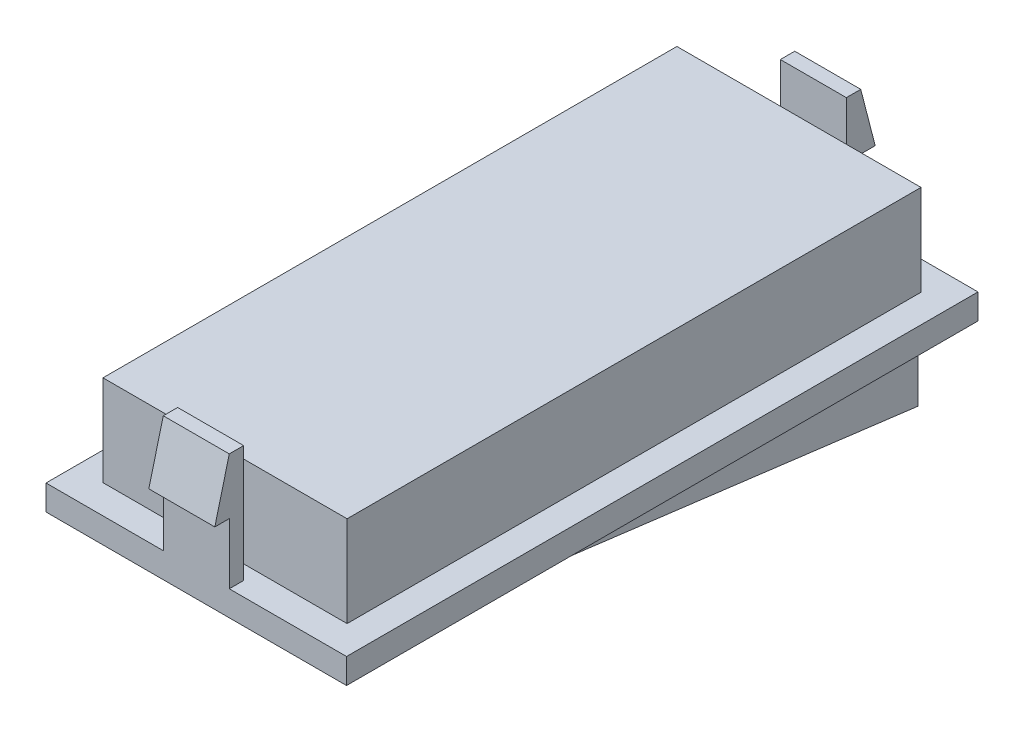
ISO-10303-21;
HEADER;
FILE_DESCRIPTION(('STEP AP214'),'2;1');
FILE_NAME('part.step','',(''),(''),'','','');
FILE_SCHEMA(('AUTOMOTIVE_DESIGN { 1 0 10303 214 1 1 1 1 }'));
ENDSEC;
DATA;
#1=APPLICATION_CONTEXT('core data for automotive mechanical design processes');
#2=APPLICATION_PROTOCOL_DEFINITION('international standard','automotive_design',2000,#1);
#3=PRODUCT_CONTEXT('',#1,'mechanical');
#4=PRODUCT('Part','Part','',(#3));
#5=PRODUCT_RELATED_PRODUCT_CATEGORY('part','',(#4));
#6=PRODUCT_DEFINITION_FORMATION('','',#4);
#7=PRODUCT_DEFINITION_CONTEXT('part definition',#1,'design');
#8=PRODUCT_DEFINITION('design','',#6,#7);
#9=PRODUCT_DEFINITION_SHAPE('','',#8);
#10=(LENGTH_UNIT() NAMED_UNIT(*) SI_UNIT(.MILLI.,.METRE.));
#11=(NAMED_UNIT(*) PLANE_ANGLE_UNIT() SI_UNIT($,.RADIAN.));
#12=(NAMED_UNIT(*) SI_UNIT($,.STERADIAN.) SOLID_ANGLE_UNIT());
#13=UNCERTAINTY_MEASURE_WITH_UNIT(LENGTH_MEASURE(1.E-05),#10,'distance_accuracy_value','');
#14=(GEOMETRIC_REPRESENTATION_CONTEXT(3) GLOBAL_UNCERTAINTY_ASSIGNED_CONTEXT((#13)) GLOBAL_UNIT_ASSIGNED_CONTEXT((#10,
#11,#12)) REPRESENTATION_CONTEXT('',''));
#15=CARTESIAN_POINT('',(0.,0.,0.));
#16=DIRECTION('',(0.,0.,1.));
#17=DIRECTION('',(1.,0.,0.));
#18=AXIS2_PLACEMENT_3D('',#15,#16,#17);
#19=CARTESIAN_POINT('',(-12.065,2.02,25.35));
#20=DIRECTION('',(0.,0.,-1.));
#21=DIRECTION('',(-1.,0.,0.));
#22=AXIS2_PLACEMENT_3D('',#19,#20,#21);
#23=PLANE('',#22);
#24=DIRECTION('',(1.,0.,0.));
#25=VECTOR('',#24,1.);
#26=CARTESIAN_POINT('',(-7.29710662670871,6.9,25.35));
#27=LINE('',#26,#25);
#28=CARTESIAN_POINT('',(-2.65,6.9,25.35));
#29=VERTEX_POINT('',#28);
#30=CARTESIAN_POINT('',(2.65,6.9,25.35));
#31=VERTEX_POINT('',#30);
#32=EDGE_CURVE('E55',#29,#31,#27,.T.);
#33=ORIENTED_EDGE('',*,*,#32,.F.);
#34=DIRECTION('',(0.,1.,0.));
#35=VECTOR('',#34,1.);
#36=CARTESIAN_POINT('',(-2.65,11.4,25.35));
#37=LINE('',#36,#35);
#38=CARTESIAN_POINT('',(-2.65,2.02,25.35));
#39=VERTEX_POINT('',#38);
#40=EDGE_CURVE('E201',#39,#29,#37,.T.);
#41=ORIENTED_EDGE('',*,*,#40,.F.);
#42=DIRECTION('',(1.,0.,0.));
#43=VECTOR('',#42,1.);
#44=CARTESIAN_POINT('',(-12.065,2.02,25.35));
#45=LINE('',#44,#43);
#46=CARTESIAN_POINT('',(-12.065,2.02,25.35));
#47=VERTEX_POINT('',#46);
#48=EDGE_CURVE('E361',#47,#39,#45,.T.);
#49=ORIENTED_EDGE('',*,*,#48,.F.);
#50=DIRECTION('',(0.,-1.,0.));
#51=VECTOR('',#50,1.);
#52=CARTESIAN_POINT('',(-12.065,2.02,25.35));
#53=LINE('',#52,#51);
#54=CARTESIAN_POINT('',(-12.065,0.,25.35));
#55=VERTEX_POINT('',#54);
#56=EDGE_CURVE('E11',#47,#55,#53,.T.);
#57=ORIENTED_EDGE('',*,*,#56,.T.);
#58=DIRECTION('',(1.,0.,0.));
#59=VECTOR('',#58,1.);
#60=CARTESIAN_POINT('',(-12.065,0.,25.35));
#61=LINE('',#60,#59);
#62=CARTESIAN_POINT('',(12.065,0.,25.35));
#63=VERTEX_POINT('',#62);
#64=EDGE_CURVE('E354',#55,#63,#61,.T.);
#65=ORIENTED_EDGE('',*,*,#64,.T.);
#66=DIRECTION('',(0.,-1.,0.));
#67=VECTOR('',#66,1.);
#68=CARTESIAN_POINT('',(12.065,2.02,25.35));
#69=LINE('',#68,#67);
#70=CARTESIAN_POINT('',(12.065,2.02,25.35));
#71=VERTEX_POINT('',#70);
#72=EDGE_CURVE('E47',#71,#63,#69,.T.);
#73=ORIENTED_EDGE('',*,*,#72,.F.);
#74=CARTESIAN_POINT('',(2.65,2.02,25.35));
#75=VERTEX_POINT('',#74);
#76=EDGE_CURVE('E195',#75,#71,#45,.T.);
#77=ORIENTED_EDGE('',*,*,#76,.F.);
#78=DIRECTION('',(0.,-1.,0.));
#79=VECTOR('',#78,1.);
#80=CARTESIAN_POINT('',(2.65,11.4,25.35));
#81=LINE('',#80,#79);
#82=EDGE_CURVE('E193',#31,#75,#81,.T.);
#83=ORIENTED_EDGE('',*,*,#82,.F.);
#84=EDGE_LOOP('',(#33,#41,#49,#57,#65,#73,#77,#83));
#85=FACE_BOUND('',#84,.T.);
#86=ADVANCED_FACE('F38',(#85),#23,.F.);
#87=CARTESIAN_POINT('',(0.,2.02,0.));
#88=DIRECTION('',(0.,-1.,0.));
#89=DIRECTION('',(0.,0.,-1.));
#90=AXIS2_PLACEMENT_3D('',#87,#88,#89);
#91=PLANE('',#90);
#92=DIRECTION('',(0.,0.,-1.));
#93=VECTOR('',#92,1.);
#94=CARTESIAN_POINT('',(9.8,2.02,23.04));
#95=LINE('',#94,#93);
#96=CARTESIAN_POINT('',(9.8,2.02,23.04));
#97=VERTEX_POINT('',#96);
#98=CARTESIAN_POINT('',(9.8,2.02,-23.04));
#99=VERTEX_POINT('',#98);
#100=EDGE_CURVE('E298',#97,#99,#95,.T.);
#101=ORIENTED_EDGE('',*,*,#100,.F.);
#102=DIRECTION('',(1.,0.,0.));
#103=VECTOR('',#102,1.);
#104=CARTESIAN_POINT('',(-9.8,2.02,23.04));
#105=LINE('',#104,#103);
#106=CARTESIAN_POINT('',(-9.8,2.02,23.04));
#107=VERTEX_POINT('',#106);
#108=EDGE_CURVE('E321',#107,#97,#105,.T.);
#109=ORIENTED_EDGE('',*,*,#108,.F.);
#110=DIRECTION('',(0.,0.,1.));
#111=VECTOR('',#110,1.);
#112=CARTESIAN_POINT('',(-9.8,2.02,23.04));
#113=LINE('',#112,#111);
#114=CARTESIAN_POINT('',(-9.8,2.02,-23.04));
#115=VERTEX_POINT('',#114);
#116=EDGE_CURVE('E333',#115,#107,#113,.T.);
#117=ORIENTED_EDGE('',*,*,#116,.F.);
#118=DIRECTION('',(-1.,0.,0.));
#119=VECTOR('',#118,1.);
#120=CARTESIAN_POINT('',(-9.8,2.02,-23.04));
#121=LINE('',#120,#119);
#122=EDGE_CURVE('E330',#99,#115,#121,.T.);
#123=ORIENTED_EDGE('',*,*,#122,.F.);
#124=EDGE_LOOP('',(#101,#109,#117,#123));
#125=FACE_BOUND('',#124,.T.);
#126=DIRECTION('',(0.,0.,1.));
#127=VECTOR('',#126,1.);
#128=CARTESIAN_POINT('',(-2.65,2.02,24.195));
#129=LINE('',#128,#127);
#130=CARTESIAN_POINT('',(-2.65,2.02,24.195));
#131=VERTEX_POINT('',#130);
#132=EDGE_CURVE('E63',#131,#39,#129,.T.);
#133=ORIENTED_EDGE('',*,*,#132,.F.);
#134=DIRECTION('',(-1.,0.,0.));
#135=VECTOR('',#134,1.);
#136=CARTESIAN_POINT('',(2.65,2.02,24.195));
#137=LINE('',#136,#135);
#138=CARTESIAN_POINT('',(2.65,2.02,24.195));
#139=VERTEX_POINT('',#138);
#140=EDGE_CURVE('E228',#139,#131,#137,.T.);
#141=ORIENTED_EDGE('',*,*,#140,.F.);
#142=DIRECTION('',(0.,0.,1.));
#143=VECTOR('',#142,1.);
#144=CARTESIAN_POINT('',(2.65,2.02,24.195));
#145=LINE('',#144,#143);
#146=EDGE_CURVE('E242',#139,#75,#145,.T.);
#147=ORIENTED_EDGE('',*,*,#146,.T.);
#148=ORIENTED_EDGE('',*,*,#76,.T.);
#149=DIRECTION('',(0.,0.,-1.));
#150=VECTOR('',#149,1.);
#151=CARTESIAN_POINT('',(12.065,2.02,25.35));
#152=LINE('',#151,#150);
#153=CARTESIAN_POINT('',(12.065,2.02,-25.35));
#154=VERTEX_POINT('',#153);
#155=EDGE_CURVE('E358',#71,#154,#152,.T.);
#156=ORIENTED_EDGE('',*,*,#155,.T.);
#157=DIRECTION('',(1.,0.,0.));
#158=VECTOR('',#157,1.);
#159=CARTESIAN_POINT('',(-12.065,2.02,-25.35));
#160=LINE('',#159,#158);
#161=CARTESIAN_POINT('',(2.64999999999999,2.02,-25.35));
#162=VERTEX_POINT('',#161);
#163=EDGE_CURVE('E353',#162,#154,#160,.T.);
#164=ORIENTED_EDGE('',*,*,#163,.F.);
#165=DIRECTION('',(0.,0.,-1.));
#166=VECTOR('',#165,1.);
#167=CARTESIAN_POINT('',(2.65,2.02,-24.195));
#168=LINE('',#167,#166);
#169=CARTESIAN_POINT('',(2.65,2.02,-24.195));
#170=VERTEX_POINT('',#169);
#171=EDGE_CURVE('E283',#170,#162,#168,.T.);
#172=ORIENTED_EDGE('',*,*,#171,.F.);
#173=DIRECTION('',(-1.,0.,0.));
#174=VECTOR('',#173,1.);
#175=CARTESIAN_POINT('',(2.65,2.02,-24.195));
#176=LINE('',#175,#174);
#177=CARTESIAN_POINT('',(-2.65,2.02,-24.195));
#178=VERTEX_POINT('',#177);
#179=EDGE_CURVE('E270',#170,#178,#176,.T.);
#180=ORIENTED_EDGE('',*,*,#179,.T.);
#181=DIRECTION('',(0.,0.,-1.));
#182=VECTOR('',#181,1.);
#183=CARTESIAN_POINT('',(-2.65,2.02,-24.195));
#184=LINE('',#183,#182);
#185=CARTESIAN_POINT('',(-2.65,2.02,-25.35));
#186=VERTEX_POINT('',#185);
#187=EDGE_CURVE('E279',#178,#186,#184,.T.);
#188=ORIENTED_EDGE('',*,*,#187,.T.);
#189=CARTESIAN_POINT('',(-12.065,2.02,-25.35));
#190=VERTEX_POINT('',#189);
#191=EDGE_CURVE('E355',#190,#186,#160,.T.);
#192=ORIENTED_EDGE('',*,*,#191,.F.);
#193=DIRECTION('',(0.,0.,-1.));
#194=VECTOR('',#193,1.);
#195=CARTESIAN_POINT('',(-12.065,2.02,25.35));
#196=LINE('',#195,#194);
#197=EDGE_CURVE('E350',#47,#190,#196,.T.);
#198=ORIENTED_EDGE('',*,*,#197,.F.);
#199=ORIENTED_EDGE('',*,*,#48,.T.);
#200=EDGE_LOOP('',(#133,#141,#147,#148,#156,#164,#172,#180,#188,#192,#198,#199));
#201=FACE_BOUND('',#200,.T.);
#202=ADVANCED_FACE('F391',(#125,#201),#91,.F.);
#203=CARTESIAN_POINT('',(-12.065,2.02,-25.35));
#204=DIRECTION('',(0.,0.,-1.));
#205=DIRECTION('',(-1.,0.,0.));
#206=AXIS2_PLACEMENT_3D('',#203,#204,#205);
#207=PLANE('',#206);
#208=DIRECTION('',(0.,1.,0.));
#209=VECTOR('',#208,1.);
#210=CARTESIAN_POINT('',(-2.65,11.4,-25.35));
#211=LINE('',#210,#209);
#212=CARTESIAN_POINT('',(-2.65,6.9,-25.35));
#213=VERTEX_POINT('',#212);
#214=EDGE_CURVE('E253',#186,#213,#211,.T.);
#215=ORIENTED_EDGE('',*,*,#214,.T.);
#216=DIRECTION('',(1.,0.,0.));
#217=VECTOR('',#216,1.);
#218=CARTESIAN_POINT('',(-7.29710662670871,6.9,-25.35));
#219=LINE('',#218,#217);
#220=CARTESIAN_POINT('',(2.65,6.9,-25.35));
#221=VERTEX_POINT('',#220);
#222=EDGE_CURVE('E248',#213,#221,#219,.T.);
#223=ORIENTED_EDGE('',*,*,#222,.T.);
#224=DIRECTION('',(0.,-1.,0.));
#225=VECTOR('',#224,1.);
#226=CARTESIAN_POINT('',(2.65,11.4,-25.35));
#227=LINE('',#226,#225);
#228=EDGE_CURVE('E265',#221,#162,#227,.T.);
#229=ORIENTED_EDGE('',*,*,#228,.T.);
#230=ORIENTED_EDGE('',*,*,#163,.T.);
#231=DIRECTION('',(0.,-1.,0.));
#232=VECTOR('',#231,1.);
#233=CARTESIAN_POINT('',(12.065,2.02,-25.35));
#234=LINE('',#233,#232);
#235=CARTESIAN_POINT('',(12.065,0.,-25.35));
#236=VERTEX_POINT('',#235);
#237=EDGE_CURVE('E373',#154,#236,#234,.T.);
#238=ORIENTED_EDGE('',*,*,#237,.T.);
#239=DIRECTION('',(1.,0.,0.));
#240=VECTOR('',#239,1.);
#241=CARTESIAN_POINT('',(-12.065,0.,-25.35));
#242=LINE('',#241,#240);
#243=CARTESIAN_POINT('',(-12.065,0.,-25.35));
#244=VERTEX_POINT('',#243);
#245=EDGE_CURVE('E365',#244,#236,#242,.T.);
#246=ORIENTED_EDGE('',*,*,#245,.F.);
#247=DIRECTION('',(0.,-1.,0.));
#248=VECTOR('',#247,1.);
#249=CARTESIAN_POINT('',(-12.065,2.02,-25.35));
#250=LINE('',#249,#248);
#251=EDGE_CURVE('E42',#190,#244,#250,.T.);
#252=ORIENTED_EDGE('',*,*,#251,.F.);
#253=ORIENTED_EDGE('',*,*,#191,.T.);
#254=EDGE_LOOP('',(#215,#223,#229,#230,#238,#246,#252,#253));
#255=FACE_BOUND('',#254,.T.);
#256=ADVANCED_FACE('F381',(#255),#207,.T.);
#257=CARTESIAN_POINT('',(-12.065,2.02,25.35));
#258=DIRECTION('',(-1.,0.,0.));
#259=DIRECTION('',(0.,0.,1.));
#260=AXIS2_PLACEMENT_3D('',#257,#258,#259);
#261=PLANE('',#260);
#262=DIRECTION('',(0.,0.,-1.));
#263=VECTOR('',#262,1.);
#264=CARTESIAN_POINT('',(-12.065,0.,25.35));
#265=LINE('',#264,#263);
#266=EDGE_CURVE('E349',#55,#244,#265,.T.);
#267=ORIENTED_EDGE('',*,*,#266,.F.);
#268=ORIENTED_EDGE('',*,*,#56,.F.);
#269=ORIENTED_EDGE('',*,*,#197,.T.);
#270=ORIENTED_EDGE('',*,*,#251,.T.);
#271=EDGE_LOOP('',(#267,#268,#269,#270));
#272=FACE_BOUND('',#271,.T.);
#273=ADVANCED_FACE('F40',(#272),#261,.T.);
#274=CARTESIAN_POINT('',(12.065,2.02,25.35));
#275=DIRECTION('',(-1.,0.,0.));
#276=DIRECTION('',(0.,0.,1.));
#277=AXIS2_PLACEMENT_3D('',#274,#275,#276);
#278=PLANE('',#277);
#279=DIRECTION('',(0.,0.,-1.));
#280=VECTOR('',#279,1.);
#281=CARTESIAN_POINT('',(12.065,0.,25.35));
#282=LINE('',#281,#280);
#283=EDGE_CURVE('E368',#63,#236,#282,.T.);
#284=ORIENTED_EDGE('',*,*,#283,.T.);
#285=ORIENTED_EDGE('',*,*,#237,.F.);
#286=ORIENTED_EDGE('',*,*,#155,.F.);
#287=ORIENTED_EDGE('',*,*,#72,.T.);
#288=EDGE_LOOP('',(#284,#285,#286,#287));
#289=FACE_BOUND('',#288,.T.);
#290=ADVANCED_FACE('F389',(#289),#278,.F.);
#291=CARTESIAN_POINT('',(0.,0.,0.));
#292=DIRECTION('',(0.,-1.,0.));
#293=DIRECTION('',(0.,0.,-1.));
#294=AXIS2_PLACEMENT_3D('',#291,#292,#293);
#295=PLANE('',#294);
#296=DIRECTION('',(1.,0.,0.));
#297=VECTOR('',#296,1.);
#298=CARTESIAN_POINT('',(-55.8306603191244,0.,-22.7812510723654));
#299=LINE('',#298,#297);
#300=CARTESIAN_POINT('',(-9.8,0.,-22.7812510723654));
#301=VERTEX_POINT('',#300);
#302=CARTESIAN_POINT('',(9.8,0.,-22.7812510723654));
#303=VERTEX_POINT('',#302);
#304=EDGE_CURVE('E309',#301,#303,#299,.T.);
#305=ORIENTED_EDGE('',*,*,#304,.F.);
#306=DIRECTION('',(0.,0.,1.));
#307=VECTOR('',#306,1.);
#308=CARTESIAN_POINT('',(-9.8,0.,23.04));
#309=LINE('',#308,#307);
#310=CARTESIAN_POINT('',(-9.8,0.,22.8849433915694));
#311=VERTEX_POINT('',#310);
#312=EDGE_CURVE('E291',#301,#311,#309,.T.);
#313=ORIENTED_EDGE('',*,*,#312,.T.);
#314=DIRECTION('',(1.,0.,0.));
#315=VECTOR('',#314,1.);
#316=CARTESIAN_POINT('',(-55.8306603191244,0.,22.8849433915694));
#317=LINE('',#316,#315);
#318=CARTESIAN_POINT('',(9.8,0.,22.8849433915694));
#319=VERTEX_POINT('',#318);
#320=EDGE_CURVE('E312',#311,#319,#317,.T.);
#321=ORIENTED_EDGE('',*,*,#320,.T.);
#322=DIRECTION('',(0.,0.,-1.));
#323=VECTOR('',#322,1.);
#324=CARTESIAN_POINT('',(9.8,0.,23.04));
#325=LINE('',#324,#323);
#326=EDGE_CURVE('E301',#319,#303,#325,.T.);
#327=ORIENTED_EDGE('',*,*,#326,.T.);
#328=EDGE_LOOP('',(#305,#313,#321,#327));
#329=FACE_BOUND('',#328,.T.);
#330=ORIENTED_EDGE('',*,*,#266,.T.);
#331=ORIENTED_EDGE('',*,*,#245,.T.);
#332=ORIENTED_EDGE('',*,*,#283,.F.);
#333=ORIENTED_EDGE('',*,*,#64,.F.);
#334=EDGE_LOOP('',(#330,#331,#332,#333));
#335=FACE_BOUND('',#334,.T.);
#336=ADVANCED_FACE('F385',(#329,#335),#295,.T.);
#337=CARTESIAN_POINT('',(9.8,9.31,23.04));
#338=DIRECTION('',(-1.,0.,0.));
#339=DIRECTION('',(0.,0.,1.));
#340=AXIS2_PLACEMENT_3D('',#337,#338,#339);
#341=PLANE('',#340);
#342=ORIENTED_EDGE('',*,*,#100,.T.);
#343=DIRECTION('',(0.,-1.,0.));
#344=VECTOR('',#343,1.);
#345=CARTESIAN_POINT('',(9.8,9.31,-23.04));
#346=LINE('',#345,#344);
#347=CARTESIAN_POINT('',(9.8,9.31,-23.04));
#348=VERTEX_POINT('',#347);
#349=EDGE_CURVE('E346',#348,#99,#346,.T.);
#350=ORIENTED_EDGE('',*,*,#349,.F.);
#351=DIRECTION('',(0.,0.,-1.));
#352=VECTOR('',#351,1.);
#353=CARTESIAN_POINT('',(9.8,9.31,23.04));
#354=LINE('',#353,#352);
#355=CARTESIAN_POINT('',(9.8,9.31,23.04));
#356=VERTEX_POINT('',#355);
#357=EDGE_CURVE('E317',#356,#348,#354,.T.);
#358=ORIENTED_EDGE('',*,*,#357,.F.);
#359=DIRECTION('',(0.,-1.,0.));
#360=VECTOR('',#359,1.);
#361=CARTESIAN_POINT('',(9.8,9.31,23.04));
#362=LINE('',#361,#360);
#363=EDGE_CURVE('E327',#356,#97,#362,.T.);
#364=ORIENTED_EDGE('',*,*,#363,.T.);
#365=EDGE_LOOP('',(#342,#350,#358,#364));
#366=FACE_BOUND('',#365,.T.);
#367=ADVANCED_FACE('F467',(#366),#341,.F.);
#368=CARTESIAN_POINT('',(-9.8,9.31,-23.04));
#369=DIRECTION('',(0.,0.,1.));
#370=DIRECTION('',(1.,0.,0.));
#371=AXIS2_PLACEMENT_3D('',#368,#369,#370);
#372=PLANE('',#371);
#373=ORIENTED_EDGE('',*,*,#122,.T.);
#374=DIRECTION('',(0.,-1.,0.));
#375=VECTOR('',#374,1.);
#376=CARTESIAN_POINT('',(-9.8,9.31,-23.04));
#377=LINE('',#376,#375);
#378=CARTESIAN_POINT('',(-9.8,9.31,-23.04));
#379=VERTEX_POINT('',#378);
#380=EDGE_CURVE('E343',#379,#115,#377,.T.);
#381=ORIENTED_EDGE('',*,*,#380,.F.);
#382=DIRECTION('',(-1.,0.,0.));
#383=VECTOR('',#382,1.);
#384=CARTESIAN_POINT('',(-9.8,9.31,-23.04));
#385=LINE('',#384,#383);
#386=EDGE_CURVE('E320',#348,#379,#385,.T.);
#387=ORIENTED_EDGE('',*,*,#386,.F.);
#388=ORIENTED_EDGE('',*,*,#349,.T.);
#389=EDGE_LOOP('',(#373,#381,#387,#388));
#390=FACE_BOUND('',#389,.T.);
#391=ADVANCED_FACE('F477',(#390),#372,.F.);
#392=CARTESIAN_POINT('',(-9.8,9.31,23.04));
#393=DIRECTION('',(1.,0.,0.));
#394=DIRECTION('',(0.,0.,-1.));
#395=AXIS2_PLACEMENT_3D('',#392,#393,#394);
#396=PLANE('',#395);
#397=ORIENTED_EDGE('',*,*,#116,.T.);
#398=DIRECTION('',(0.,-1.,0.));
#399=VECTOR('',#398,1.);
#400=CARTESIAN_POINT('',(-9.8,9.31,23.04));
#401=LINE('',#400,#399);
#402=CARTESIAN_POINT('',(-9.8,9.31,23.04));
#403=VERTEX_POINT('',#402);
#404=EDGE_CURVE('E340',#403,#107,#401,.T.);
#405=ORIENTED_EDGE('',*,*,#404,.F.);
#406=DIRECTION('',(0.,0.,1.));
#407=VECTOR('',#406,1.);
#408=CARTESIAN_POINT('',(-9.8,9.31,23.04));
#409=LINE('',#408,#407);
#410=EDGE_CURVE('E323',#379,#403,#409,.T.);
#411=ORIENTED_EDGE('',*,*,#410,.F.);
#412=ORIENTED_EDGE('',*,*,#380,.T.);
#413=EDGE_LOOP('',(#397,#405,#411,#412));
#414=FACE_BOUND('',#413,.T.);
#415=ADVANCED_FACE('F484',(#414),#396,.F.);
#416=CARTESIAN_POINT('',(-9.8,9.31,23.04));
#417=DIRECTION('',(0.,0.,-1.));
#418=DIRECTION('',(-1.,0.,0.));
#419=AXIS2_PLACEMENT_3D('',#416,#417,#418);
#420=PLANE('',#419);
#421=ORIENTED_EDGE('',*,*,#108,.T.);
#422=ORIENTED_EDGE('',*,*,#363,.F.);
#423=DIRECTION('',(1.,0.,0.));
#424=VECTOR('',#423,1.);
#425=CARTESIAN_POINT('',(-9.8,9.31,23.04));
#426=LINE('',#425,#424);
#427=EDGE_CURVE('E325',#403,#356,#426,.T.);
#428=ORIENTED_EDGE('',*,*,#427,.F.);
#429=ORIENTED_EDGE('',*,*,#404,.T.);
#430=EDGE_LOOP('',(#421,#422,#428,#429));
#431=FACE_BOUND('',#430,.T.);
#432=ADVANCED_FACE('F492',(#431),#420,.F.);
#433=CARTESIAN_POINT('',(0.,9.31,0.));
#434=DIRECTION('',(0.,-1.,0.));
#435=DIRECTION('',(0.,0.,-1.));
#436=AXIS2_PLACEMENT_3D('',#433,#434,#435);
#437=PLANE('',#436);
#438=ORIENTED_EDGE('',*,*,#357,.T.);
#439=ORIENTED_EDGE('',*,*,#386,.T.);
#440=ORIENTED_EDGE('',*,*,#410,.T.);
#441=ORIENTED_EDGE('',*,*,#427,.T.);
#442=EDGE_LOOP('',(#438,#439,#440,#441));
#443=FACE_BOUND('',#442,.T.);
#444=ADVANCED_FACE('F500',(#443),#437,.F.);
#445=CARTESIAN_POINT('',(9.8,0.,0.));
#446=DIRECTION('',(1.,0.,0.));
#447=DIRECTION('',(0.,0.,-1.));
#448=AXIS2_PLACEMENT_3D('',#445,#446,#447);
#449=PLANE('',#448);
#450=DIRECTION('',(0.,0.125590976946734,0.992082106737928));
#451=VECTOR('',#450,1.);
#452=CARTESIAN_POINT('',(9.8,0.166167020566189,24.1975482604972));
#453=LINE('',#452,#451);
#454=CARTESIAN_POINT('',(9.8,-5.78103559898209,-22.7812510723654));
#455=VERTEX_POINT('',#454);
#456=EDGE_CURVE('E282',#455,#319,#453,.T.);
#457=ORIENTED_EDGE('',*,*,#456,.F.);
#458=DIRECTION('',(0.,-1.,0.));
#459=VECTOR('',#458,1.);
#460=CARTESIAN_POINT('',(9.8,9.31000000000006,-22.7812510723654));
#461=LINE('',#460,#459);
#462=EDGE_CURVE('E304',#303,#455,#461,.T.);
#463=ORIENTED_EDGE('',*,*,#462,.F.);
#464=ORIENTED_EDGE('',*,*,#326,.F.);
#465=EDGE_LOOP('',(#457,#463,#464));
#466=FACE_BOUND('',#465,.T.);
#467=ADVANCED_FACE('F507',(#466),#449,.T.);
#468=CARTESIAN_POINT('',(-55.8306603191244,9.31000000000006,-22.7812510723654));
#469=DIRECTION('',(0.,0.,1.));
#470=DIRECTION('',(0.,-1.,0.));
#471=AXIS2_PLACEMENT_3D('',#468,#469,#470);
#472=PLANE('',#471);
#473=DIRECTION('',(1.,0.,0.));
#474=VECTOR('',#473,1.);
#475=CARTESIAN_POINT('',(-55.8306603191244,-5.78103559898209,-22.7812510723654));
#476=LINE('',#475,#474);
#477=CARTESIAN_POINT('',(-9.8,-5.78103559898209,-22.7812510723654));
#478=VERTEX_POINT('',#477);
#479=EDGE_CURVE('E307',#478,#455,#476,.T.);
#480=ORIENTED_EDGE('',*,*,#479,.F.);
#481=DIRECTION('',(0.,1.,0.));
#482=VECTOR('',#481,1.);
#483=CARTESIAN_POINT('',(-9.8,9.31000000000006,-22.7812510723654));
#484=LINE('',#483,#482);
#485=EDGE_CURVE('E295',#478,#301,#484,.T.);
#486=ORIENTED_EDGE('',*,*,#485,.T.);
#487=ORIENTED_EDGE('',*,*,#304,.T.);
#488=ORIENTED_EDGE('',*,*,#462,.T.);
#489=EDGE_LOOP('',(#480,#486,#487,#488));
#490=FACE_BOUND('',#489,.T.);
#491=ADVANCED_FACE('F514',(#490),#472,.F.);
#492=CARTESIAN_POINT('',(-55.8306603191244,0.166167020566189,24.1975482604972));
#493=DIRECTION('',(0.,0.992082106737928,-0.125590976946734));
#494=DIRECTION('',(0.,0.125590976946734,0.992082106737928));
#495=AXIS2_PLACEMENT_3D('',#492,#493,#494);
#496=PLANE('',#495);
#497=ORIENTED_EDGE('',*,*,#320,.F.);
#498=DIRECTION('',(0.,-0.125590976946734,-0.992082106737928));
#499=VECTOR('',#498,1.);
#500=CARTESIAN_POINT('',(-9.8,0.166167020566189,24.1975482604972));
#501=LINE('',#500,#499);
#502=EDGE_CURVE('E294',#311,#478,#501,.T.);
#503=ORIENTED_EDGE('',*,*,#502,.T.);
#504=ORIENTED_EDGE('',*,*,#479,.T.);
#505=ORIENTED_EDGE('',*,*,#456,.T.);
#506=EDGE_LOOP('',(#497,#503,#504,#505));
#507=FACE_BOUND('',#506,.T.);
#508=ADVANCED_FACE('F522',(#507),#496,.F.);
#509=CARTESIAN_POINT('',(-9.8,9.31,23.04));
#510=DIRECTION('',(1.,0.,0.));
#511=DIRECTION('',(0.,0.,-1.));
#512=AXIS2_PLACEMENT_3D('',#509,#510,#511);
#513=PLANE('',#512);
#514=ORIENTED_EDGE('',*,*,#312,.F.);
#515=ORIENTED_EDGE('',*,*,#485,.F.);
#516=ORIENTED_EDGE('',*,*,#502,.F.);
#517=EDGE_LOOP('',(#514,#515,#516));
#518=FACE_BOUND('',#517,.T.);
#519=ADVANCED_FACE('F529',(#518),#513,.F.);
#520=CARTESIAN_POINT('',(-2.65,11.4,-24.195));
#521=DIRECTION('',(-1.,0.,0.));
#522=DIRECTION('',(0.,-1.,0.));
#523=AXIS2_PLACEMENT_3D('',#520,#521,#522);
#524=PLANE('',#523);
#525=ORIENTED_EDGE('',*,*,#214,.F.);
#526=ORIENTED_EDGE('',*,*,#187,.F.);
#527=DIRECTION('',(0.,1.,0.));
#528=VECTOR('',#527,1.);
#529=CARTESIAN_POINT('',(-2.65,11.4,-24.195));
#530=LINE('',#529,#528);
#531=CARTESIAN_POINT('',(-2.65,11.4,-24.195));
#532=VERTEX_POINT('',#531);
#533=EDGE_CURVE('E261',#178,#532,#530,.T.);
#534=ORIENTED_EDGE('',*,*,#533,.T.);
#535=DIRECTION('',(0.,0.,-1.));
#536=VECTOR('',#535,1.);
#537=CARTESIAN_POINT('',(-2.65,11.4,-24.195));
#538=LINE('',#537,#536);
#539=CARTESIAN_POINT('',(-2.65,11.4,-25.35));
#540=VERTEX_POINT('',#539);
#541=EDGE_CURVE('E273',#532,#540,#538,.T.);
#542=ORIENTED_EDGE('',*,*,#541,.T.);
#543=DIRECTION('',(0.,0.968344469252496,0.24961768540731));
#544=VECTOR('',#543,1.);
#545=CARTESIAN_POINT('',(-2.65,6.9,-26.51));
#546=LINE('',#545,#544);
#547=CARTESIAN_POINT('',(-2.65,6.9,-26.51));
#548=VERTEX_POINT('',#547);
#549=EDGE_CURVE('E251',#548,#540,#546,.T.);
#550=ORIENTED_EDGE('',*,*,#549,.F.);
#551=DIRECTION('',(0.,0.,-1.));
#552=VECTOR('',#551,1.);
#553=CARTESIAN_POINT('',(-2.65,6.9,-25.35));
#554=LINE('',#553,#552);
#555=EDGE_CURVE('E255',#213,#548,#554,.T.);
#556=ORIENTED_EDGE('',*,*,#555,.F.);
#557=EDGE_LOOP('',(#525,#526,#534,#542,#550,#556));
#558=FACE_BOUND('',#557,.T.);
#559=ADVANCED_FACE('F410',(#558),#524,.T.);
#560=CARTESIAN_POINT('',(2.65,11.4,-24.195));
#561=DIRECTION('',(1.,0.,0.));
#562=DIRECTION('',(0.,1.,0.));
#563=AXIS2_PLACEMENT_3D('',#560,#561,#562);
#564=PLANE('',#563);
#565=ORIENTED_EDGE('',*,*,#228,.F.);
#566=DIRECTION('',(0.,0.,-1.));
#567=VECTOR('',#566,1.);
#568=CARTESIAN_POINT('',(2.65,6.9,-25.35));
#569=LINE('',#568,#567);
#570=CARTESIAN_POINT('',(2.65,6.9,-26.51));
#571=VERTEX_POINT('',#570);
#572=EDGE_CURVE('E245',#221,#571,#569,.T.);
#573=ORIENTED_EDGE('',*,*,#572,.T.);
#574=DIRECTION('',(0.,0.968344469252496,0.24961768540731));
#575=VECTOR('',#574,1.);
#576=CARTESIAN_POINT('',(2.65,6.9,-26.51));
#577=LINE('',#576,#575);
#578=CARTESIAN_POINT('',(2.65,11.4,-25.35));
#579=VERTEX_POINT('',#578);
#580=EDGE_CURVE('E239',#571,#579,#577,.T.);
#581=ORIENTED_EDGE('',*,*,#580,.T.);
#582=DIRECTION('',(0.,0.,-1.));
#583=VECTOR('',#582,1.);
#584=CARTESIAN_POINT('',(2.65,11.4,-24.195));
#585=LINE('',#584,#583);
#586=CARTESIAN_POINT('',(2.65,11.4,-24.195));
#587=VERTEX_POINT('',#586);
#588=EDGE_CURVE('E286',#587,#579,#585,.T.);
#589=ORIENTED_EDGE('',*,*,#588,.F.);
#590=DIRECTION('',(0.,-1.,0.));
#591=VECTOR('',#590,1.);
#592=CARTESIAN_POINT('',(2.65,11.4,-24.195));
#593=LINE('',#592,#591);
#594=EDGE_CURVE('E268',#587,#170,#593,.T.);
#595=ORIENTED_EDGE('',*,*,#594,.T.);
#596=ORIENTED_EDGE('',*,*,#171,.T.);
#597=EDGE_LOOP('',(#565,#573,#581,#589,#595,#596));
#598=FACE_BOUND('',#597,.T.);
#599=ADVANCED_FACE('F417',(#598),#564,.T.);
#600=CARTESIAN_POINT('',(2.65,11.4,-24.195));
#601=DIRECTION('',(0.,1.,0.));
#602=DIRECTION('',(0.,0.,1.));
#603=AXIS2_PLACEMENT_3D('',#600,#601,#602);
#604=PLANE('',#603);
#605=DIRECTION('',(1.,0.,0.));
#606=VECTOR('',#605,1.);
#607=CARTESIAN_POINT('',(2.65,11.4,-25.35));
#608=LINE('',#607,#606);
#609=EDGE_CURVE('E276',#540,#579,#608,.T.);
#610=ORIENTED_EDGE('',*,*,#609,.F.);
#611=ORIENTED_EDGE('',*,*,#541,.F.);
#612=DIRECTION('',(1.,0.,0.));
#613=VECTOR('',#612,1.);
#614=CARTESIAN_POINT('',(2.65,11.4,-24.195));
#615=LINE('',#614,#613);
#616=EDGE_CURVE('E264',#532,#587,#615,.T.);
#617=ORIENTED_EDGE('',*,*,#616,.T.);
#618=ORIENTED_EDGE('',*,*,#588,.T.);
#619=EDGE_LOOP('',(#610,#611,#617,#618));
#620=FACE_BOUND('',#619,.T.);
#621=ADVANCED_FACE('F425',(#620),#604,.T.);
#622=CARTESIAN_POINT('',(0.,0.,-24.195));
#623=DIRECTION('',(0.,0.,-1.));
#624=DIRECTION('',(-1.,0.,0.));
#625=AXIS2_PLACEMENT_3D('',#622,#623,#624);
#626=PLANE('',#625);
#627=ORIENTED_EDGE('',*,*,#533,.F.);
#628=ORIENTED_EDGE('',*,*,#179,.F.);
#629=ORIENTED_EDGE('',*,*,#594,.F.);
#630=ORIENTED_EDGE('',*,*,#616,.F.);
#631=EDGE_LOOP('',(#627,#628,#629,#630));
#632=FACE_BOUND('',#631,.T.);
#633=ADVANCED_FACE('F421',(#632),#626,.F.);
#634=CARTESIAN_POINT('',(-7.29710662670871,6.9,-25.35));
#635=DIRECTION('',(0.,-1.,0.));
#636=DIRECTION('',(1.,0.,0.));
#637=AXIS2_PLACEMENT_3D('',#634,#635,#636);
#638=PLANE('',#637);
#639=ORIENTED_EDGE('',*,*,#222,.F.);
#640=ORIENTED_EDGE('',*,*,#555,.T.);
#641=DIRECTION('',(1.,0.,0.));
#642=VECTOR('',#641,1.);
#643=CARTESIAN_POINT('',(-7.29710662670871,6.9,-26.51));
#644=LINE('',#643,#642);
#645=EDGE_CURVE('E254',#548,#571,#644,.T.);
#646=ORIENTED_EDGE('',*,*,#645,.T.);
#647=ORIENTED_EDGE('',*,*,#572,.F.);
#648=EDGE_LOOP('',(#639,#640,#646,#647));
#649=FACE_BOUND('',#648,.T.);
#650=ADVANCED_FACE('F414',(#649),#638,.T.);
#651=CARTESIAN_POINT('',(-7.29710662670871,6.9,-26.51));
#652=DIRECTION('',(0.,0.24961768540731,-0.968344469252495));
#653=DIRECTION('',(0.,0.968344469252496,0.24961768540731));
#654=AXIS2_PLACEMENT_3D('',#651,#652,#653);
#655=PLANE('',#654);
#656=ORIENTED_EDGE('',*,*,#645,.F.);
#657=ORIENTED_EDGE('',*,*,#549,.T.);
#658=ORIENTED_EDGE('',*,*,#609,.T.);
#659=ORIENTED_EDGE('',*,*,#580,.F.);
#660=EDGE_LOOP('',(#656,#657,#658,#659));
#661=FACE_BOUND('',#660,.T.);
#662=ADVANCED_FACE('F427',(#661),#655,.T.);
#663=CARTESIAN_POINT('',(-2.65,11.4,24.195));
#664=DIRECTION('',(1.,0.,0.));
#665=DIRECTION('',(0.,1.,0.));
#666=AXIS2_PLACEMENT_3D('',#663,#664,#665);
#667=PLANE('',#666);
#668=ORIENTED_EDGE('',*,*,#40,.T.);
#669=DIRECTION('',(0.,0.,1.));
#670=VECTOR('',#669,1.);
#671=CARTESIAN_POINT('',(-2.65,6.9,25.35));
#672=LINE('',#671,#670);
#673=CARTESIAN_POINT('',(-2.65,6.9,26.51));
#674=VERTEX_POINT('',#673);
#675=EDGE_CURVE('E210',#29,#674,#672,.T.);
#676=ORIENTED_EDGE('',*,*,#675,.T.);
#677=DIRECTION('',(0.,0.968344469252496,-0.24961768540731));
#678=VECTOR('',#677,1.);
#679=CARTESIAN_POINT('',(-2.65,6.9,26.51));
#680=LINE('',#679,#678);
#681=CARTESIAN_POINT('',(-2.65,11.4,25.35));
#682=VERTEX_POINT('',#681);
#683=EDGE_CURVE('E217',#674,#682,#680,.T.);
#684=ORIENTED_EDGE('',*,*,#683,.T.);
#685=DIRECTION('',(0.,0.,1.));
#686=VECTOR('',#685,1.);
#687=CARTESIAN_POINT('',(-2.65,11.4,24.195));
#688=LINE('',#687,#686);
#689=CARTESIAN_POINT('',(-2.65,11.4,24.195));
#690=VERTEX_POINT('',#689);
#691=EDGE_CURVE('E237',#690,#682,#688,.T.);
#692=ORIENTED_EDGE('',*,*,#691,.F.);
#693=DIRECTION('',(0.,1.,0.));
#694=VECTOR('',#693,1.);
#695=CARTESIAN_POINT('',(-2.65,11.4,24.195));
#696=LINE('',#695,#694);
#697=EDGE_CURVE('E225',#131,#690,#696,.T.);
#698=ORIENTED_EDGE('',*,*,#697,.F.);
#699=ORIENTED_EDGE('',*,*,#132,.T.);
#700=EDGE_LOOP('',(#668,#676,#684,#692,#698,#699));
#701=FACE_BOUND('',#700,.T.);
#702=ADVANCED_FACE('F406',(#701),#667,.F.);
#703=CARTESIAN_POINT('',(2.65,11.4,24.195));
#704=DIRECTION('',(0.,-1.,0.));
#705=DIRECTION('',(0.,0.,-1.));
#706=AXIS2_PLACEMENT_3D('',#703,#704,#705);
#707=PLANE('',#706);
#708=DIRECTION('',(1.,0.,0.));
#709=VECTOR('',#708,1.);
#710=CARTESIAN_POINT('',(2.65,11.4,25.35));
#711=LINE('',#710,#709);
#712=CARTESIAN_POINT('',(2.65,11.4,25.35));
#713=VERTEX_POINT('',#712);
#714=EDGE_CURVE('E200',#682,#713,#711,.T.);
#715=ORIENTED_EDGE('',*,*,#714,.T.);
#716=DIRECTION('',(0.,0.,1.));
#717=VECTOR('',#716,1.);
#718=CARTESIAN_POINT('',(2.65,11.4,24.195));
#719=LINE('',#718,#717);
#720=CARTESIAN_POINT('',(2.65,11.4,24.195));
#721=VERTEX_POINT('',#720);
#722=EDGE_CURVE('E240',#721,#713,#719,.T.);
#723=ORIENTED_EDGE('',*,*,#722,.F.);
#724=DIRECTION('',(1.,0.,0.));
#725=VECTOR('',#724,1.);
#726=CARTESIAN_POINT('',(2.65,11.4,24.195));
#727=LINE('',#726,#725);
#728=EDGE_CURVE('E233',#690,#721,#727,.T.);
#729=ORIENTED_EDGE('',*,*,#728,.F.);
#730=ORIENTED_EDGE('',*,*,#691,.T.);
#731=EDGE_LOOP('',(#715,#723,#729,#730));
#732=FACE_BOUND('',#731,.T.);
#733=ADVANCED_FACE('F400',(#732),#707,.F.);
#734=CARTESIAN_POINT('',(2.65,11.4,24.195));
#735=DIRECTION('',(-1.,0.,0.));
#736=DIRECTION('',(0.,-1.,0.));
#737=AXIS2_PLACEMENT_3D('',#734,#735,#736);
#738=PLANE('',#737);
#739=ORIENTED_EDGE('',*,*,#722,.T.);
#740=DIRECTION('',(0.,0.968344469252496,-0.24961768540731));
#741=VECTOR('',#740,1.);
#742=CARTESIAN_POINT('',(2.65,6.9,26.51));
#743=LINE('',#742,#741);
#744=CARTESIAN_POINT('',(2.65,6.9,26.51));
#745=VERTEX_POINT('',#744);
#746=EDGE_CURVE('E211',#745,#713,#743,.T.);
#747=ORIENTED_EDGE('',*,*,#746,.F.);
#748=DIRECTION('',(0.,0.,1.));
#749=VECTOR('',#748,1.);
#750=CARTESIAN_POINT('',(2.65,6.9,25.35));
#751=LINE('',#750,#749);
#752=EDGE_CURVE('E207',#31,#745,#751,.T.);
#753=ORIENTED_EDGE('',*,*,#752,.F.);
#754=ORIENTED_EDGE('',*,*,#82,.T.);
#755=ORIENTED_EDGE('',*,*,#146,.F.);
#756=DIRECTION('',(0.,-1.,0.));
#757=VECTOR('',#756,1.);
#758=CARTESIAN_POINT('',(2.65,11.4,24.195));
#759=LINE('',#758,#757);
#760=EDGE_CURVE('E230',#721,#139,#759,.T.);
#761=ORIENTED_EDGE('',*,*,#760,.F.);
#762=EDGE_LOOP('',(#739,#747,#753,#754,#755,#761));
#763=FACE_BOUND('',#762,.T.);
#764=ADVANCED_FACE('F214',(#763),#738,.F.);
#765=CARTESIAN_POINT('',(0.,0.,24.195));
#766=DIRECTION('',(0.,0.,1.));
#767=DIRECTION('',(-1.,0.,0.));
#768=AXIS2_PLACEMENT_3D('',#765,#766,#767);
#769=PLANE('',#768);
#770=ORIENTED_EDGE('',*,*,#697,.T.);
#771=ORIENTED_EDGE('',*,*,#728,.T.);
#772=ORIENTED_EDGE('',*,*,#760,.T.);
#773=ORIENTED_EDGE('',*,*,#140,.T.);
#774=EDGE_LOOP('',(#770,#771,#772,#773));
#775=FACE_BOUND('',#774,.T.);
#776=ADVANCED_FACE('F396',(#775),#769,.F.);
#777=CARTESIAN_POINT('',(-7.29710662670871,6.9,26.51));
#778=DIRECTION('',(0.,-0.24961768540731,-0.968344469252495));
#779=DIRECTION('',(0.,0.968344469252496,-0.24961768540731));
#780=AXIS2_PLACEMENT_3D('',#777,#778,#779);
#781=PLANE('',#780);
#782=ORIENTED_EDGE('',*,*,#683,.F.);
#783=DIRECTION('',(1.,0.,0.));
#784=VECTOR('',#783,1.);
#785=CARTESIAN_POINT('',(-7.29710662670871,6.9,26.51));
#786=LINE('',#785,#784);
#787=EDGE_CURVE('E221',#674,#745,#786,.T.);
#788=ORIENTED_EDGE('',*,*,#787,.T.);
#789=ORIENTED_EDGE('',*,*,#746,.T.);
#790=ORIENTED_EDGE('',*,*,#714,.F.);
#791=EDGE_LOOP('',(#782,#788,#789,#790));
#792=FACE_BOUND('',#791,.T.);
#793=ADVANCED_FACE('F404',(#792),#781,.F.);
#794=CARTESIAN_POINT('',(-7.29710662670871,6.9,25.35));
#795=DIRECTION('',(0.,1.,0.));
#796=DIRECTION('',(-1.,0.,0.));
#797=AXIS2_PLACEMENT_3D('',#794,#795,#796);
#798=PLANE('',#797);
#799=ORIENTED_EDGE('',*,*,#675,.F.);
#800=ORIENTED_EDGE('',*,*,#32,.T.);
#801=ORIENTED_EDGE('',*,*,#752,.T.);
#802=ORIENTED_EDGE('',*,*,#787,.F.);
#803=EDGE_LOOP('',(#799,#800,#801,#802));
#804=FACE_BOUND('',#803,.T.);
#805=ADVANCED_FACE('F206',(#804),#798,.F.);
#806=CLOSED_SHELL('',(#86,#202,#256,#273,#290,#336,#367,#391,#415,#432,#444,#467,#491,#508,#519,
#559,#599,#621,#633,#650,#662,#702,#733,#764,#776,#793,#805));
#807=MANIFOLD_SOLID_BREP('B2',#806);
#808=ADVANCED_BREP_SHAPE_REPRESENTATION('',(#18,#807),#14);
#809=SHAPE_DEFINITION_REPRESENTATION(#9,#808);
ENDSEC;
END-ISO-10303-21;
